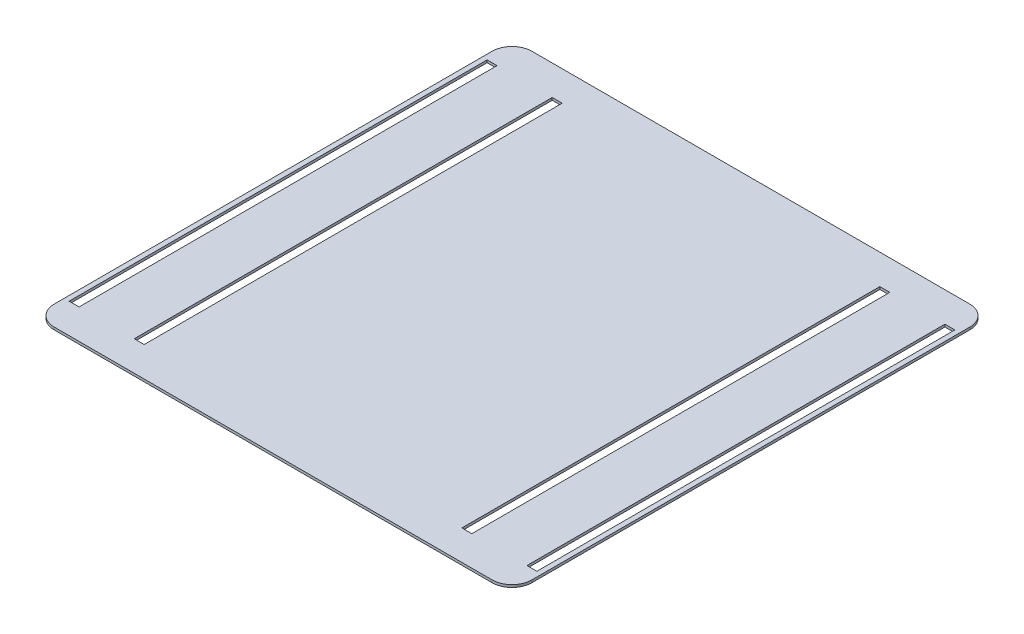
ISO-10303-21;
HEADER;
FILE_DESCRIPTION(('STEP AP214'),'2;1');
FILE_NAME('part.step','',(''),(''),'','','');
FILE_SCHEMA(('AUTOMOTIVE_DESIGN { 1 0 10303 214 1 1 1 1 }'));
ENDSEC;
DATA;
#1=APPLICATION_CONTEXT('core data for automotive mechanical design processes');
#2=APPLICATION_PROTOCOL_DEFINITION('international standard','automotive_design',2000,#1);
#3=PRODUCT_CONTEXT('',#1,'mechanical');
#4=PRODUCT('Part','Part','',(#3));
#5=PRODUCT_RELATED_PRODUCT_CATEGORY('part','',(#4));
#6=PRODUCT_DEFINITION_FORMATION('','',#4);
#7=PRODUCT_DEFINITION_CONTEXT('part definition',#1,'design');
#8=PRODUCT_DEFINITION('design','',#6,#7);
#9=PRODUCT_DEFINITION_SHAPE('','',#8);
#10=(LENGTH_UNIT() NAMED_UNIT(*) SI_UNIT(.MILLI.,.METRE.));
#11=(NAMED_UNIT(*) PLANE_ANGLE_UNIT() SI_UNIT($,.RADIAN.));
#12=(NAMED_UNIT(*) SI_UNIT($,.STERADIAN.) SOLID_ANGLE_UNIT());
#13=UNCERTAINTY_MEASURE_WITH_UNIT(LENGTH_MEASURE(1.E-05),#10,'distance_accuracy_value','');
#14=(GEOMETRIC_REPRESENTATION_CONTEXT(3) GLOBAL_UNCERTAINTY_ASSIGNED_CONTEXT((#13)) GLOBAL_UNIT_ASSIGNED_CONTEXT((#10,
#11,#12)) REPRESENTATION_CONTEXT('',''));
#15=CARTESIAN_POINT('',(0.,0.,0.));
#16=DIRECTION('',(0.,0.,1.));
#17=DIRECTION('',(1.,0.,0.));
#18=AXIS2_PLACEMENT_3D('',#15,#16,#17);
#19=CARTESIAN_POINT('',(0.,3.175,0.));
#20=DIRECTION('',(0.,-1.,0.));
#21=DIRECTION('',(0.,0.,-1.));
#22=AXIS2_PLACEMENT_3D('',#19,#20,#21);
#23=PLANE('',#22);
#24=DIRECTION('',(0.,0.,1.));
#25=VECTOR('',#24,1.);
#26=CARTESIAN_POINT('',(285.75,3.175,-266.7));
#27=LINE('',#26,#25);
#28=CARTESIAN_POINT('',(285.75,3.175,-266.7));
#29=VERTEX_POINT('',#28);
#30=CARTESIAN_POINT('',(285.75,3.175,266.7));
#31=VERTEX_POINT('',#30);
#32=EDGE_CURVE('E281',#29,#31,#27,.T.);
#33=ORIENTED_EDGE('',*,*,#32,.F.);
#34=DIRECTION('',(-1.,0.,0.));
#35=VECTOR('',#34,1.);
#36=CARTESIAN_POINT('',(298.45,3.175,-266.7));
#37=LINE('',#36,#35);
#38=CARTESIAN_POINT('',(298.45,3.175,-266.7));
#39=VERTEX_POINT('',#38);
#40=EDGE_CURVE('E48',#39,#29,#37,.T.);
#41=ORIENTED_EDGE('',*,*,#40,.F.);
#42=DIRECTION('',(0.,0.,1.));
#43=VECTOR('',#42,1.);
#44=CARTESIAN_POINT('',(298.45,3.175,-266.7));
#45=LINE('',#44,#43);
#46=CARTESIAN_POINT('',(298.45,3.175,266.7));
#47=VERTEX_POINT('',#46);
#48=EDGE_CURVE('E274',#39,#47,#45,.T.);
#49=ORIENTED_EDGE('',*,*,#48,.T.);
#50=DIRECTION('',(-1.,0.,0.));
#51=VECTOR('',#50,1.);
#52=CARTESIAN_POINT('',(298.45,3.175,266.7));
#53=LINE('',#52,#51);
#54=EDGE_CURVE('E277',#47,#31,#53,.T.);
#55=ORIENTED_EDGE('',*,*,#54,.T.);
#56=EDGE_LOOP('',(#33,#41,#49,#55));
#57=FACE_BOUND('',#56,.T.);
#58=DIRECTION('',(0.,0.,-1.));
#59=VECTOR('',#58,1.);
#60=CARTESIAN_POINT('',(202.692,3.175,0.));
#61=LINE('',#60,#59);
#62=CARTESIAN_POINT('',(202.692,3.175,266.7));
#63=VERTEX_POINT('',#62);
#64=CARTESIAN_POINT('',(202.692,3.175,-266.7));
#65=VERTEX_POINT('',#64);
#66=EDGE_CURVE('E220',#63,#65,#61,.T.);
#67=ORIENTED_EDGE('',*,*,#66,.T.);
#68=DIRECTION('',(1.,0.,0.));
#69=VECTOR('',#68,1.);
#70=CARTESIAN_POINT('',(1.16573417585642E-12,3.175,-266.700000000001));
#71=LINE('',#70,#69);
#72=CARTESIAN_POINT('',(215.392,3.175,-266.7));
#73=VERTEX_POINT('',#72);
#74=EDGE_CURVE('E297',#65,#73,#71,.T.);
#75=ORIENTED_EDGE('',*,*,#74,.T.);
#76=DIRECTION('',(0.,0.,-1.));
#77=VECTOR('',#76,1.);
#78=CARTESIAN_POINT('',(215.392,3.175,0.));
#79=LINE('',#78,#77);
#80=CARTESIAN_POINT('',(215.392,3.175,266.7));
#81=VERTEX_POINT('',#80);
#82=EDGE_CURVE('E308',#81,#73,#79,.T.);
#83=ORIENTED_EDGE('',*,*,#82,.F.);
#84=DIRECTION('',(1.,0.,0.));
#85=VECTOR('',#84,1.);
#86=CARTESIAN_POINT('',(0.,3.175,266.7));
#87=LINE('',#86,#85);
#88=EDGE_CURVE('E223',#63,#81,#87,.T.);
#89=ORIENTED_EDGE('',*,*,#88,.F.);
#90=EDGE_LOOP('',(#67,#75,#83,#89));
#91=FACE_BOUND('',#90,.T.);
#92=DIRECTION('',(-1.,0.,0.));
#93=VECTOR('',#92,1.);
#94=CARTESIAN_POINT('',(-304.8,3.175,-304.8));
#95=LINE('',#94,#93);
#96=CARTESIAN_POINT('',(279.4,3.175,-304.8));
#97=VERTEX_POINT('',#96);
#98=CARTESIAN_POINT('',(-279.4,3.175,-304.8));
#99=VERTEX_POINT('',#98);
#100=EDGE_CURVE('E326',#97,#99,#95,.T.);
#101=ORIENTED_EDGE('',*,*,#100,.T.);
#102=CARTESIAN_POINT('',(-279.4,3.175,-279.4));
#103=DIRECTION('',(0.,-1.,0.));
#104=DIRECTION('',(0.,0.,-1.));
#105=AXIS2_PLACEMENT_3D('',#102,#103,#104);
#106=CIRCLE('',#105,25.4);
#107=CARTESIAN_POINT('',(-304.8,3.175,-279.4));
#108=VERTEX_POINT('',#107);
#109=EDGE_CURVE('E370',#99,#108,#106,.F.);
#110=ORIENTED_EDGE('',*,*,#109,.T.);
#111=DIRECTION('',(0.,0.,1.));
#112=VECTOR('',#111,1.);
#113=CARTESIAN_POINT('',(-304.8,3.175,304.8));
#114=LINE('',#113,#112);
#115=CARTESIAN_POINT('',(-304.8,3.175,279.4));
#116=VERTEX_POINT('',#115);
#117=EDGE_CURVE('E330',#108,#116,#114,.T.);
#118=ORIENTED_EDGE('',*,*,#117,.T.);
#119=CARTESIAN_POINT('',(-279.4,3.175,279.4));
#120=DIRECTION('',(0.,-1.,0.));
#121=DIRECTION('',(0.,0.,-1.));
#122=AXIS2_PLACEMENT_3D('',#119,#120,#121);
#123=CIRCLE('',#122,25.4);
#124=CARTESIAN_POINT('',(-279.4,3.175,304.8));
#125=VERTEX_POINT('',#124);
#126=EDGE_CURVE('E366',#116,#125,#123,.F.);
#127=ORIENTED_EDGE('',*,*,#126,.T.);
#128=DIRECTION('',(1.,0.,0.));
#129=VECTOR('',#128,1.);
#130=CARTESIAN_POINT('',(-304.8,3.175,304.8));
#131=LINE('',#130,#129);
#132=CARTESIAN_POINT('',(279.4,3.175,304.8));
#133=VERTEX_POINT('',#132);
#134=EDGE_CURVE('E333',#125,#133,#131,.T.);
#135=ORIENTED_EDGE('',*,*,#134,.T.);
#136=CARTESIAN_POINT('',(279.4,3.175,279.4));
#137=DIRECTION('',(0.,-1.,0.));
#138=DIRECTION('',(0.,0.,-1.));
#139=AXIS2_PLACEMENT_3D('',#136,#137,#138);
#140=CIRCLE('',#139,25.4);
#141=CARTESIAN_POINT('',(304.8,3.175,279.4));
#142=VERTEX_POINT('',#141);
#143=EDGE_CURVE('E364',#133,#142,#140,.F.);
#144=ORIENTED_EDGE('',*,*,#143,.T.);
#145=DIRECTION('',(0.,0.,-1.));
#146=VECTOR('',#145,1.);
#147=CARTESIAN_POINT('',(304.8,3.175,304.8));
#148=LINE('',#147,#146);
#149=CARTESIAN_POINT('',(304.8,3.175,-279.4));
#150=VERTEX_POINT('',#149);
#151=EDGE_CURVE('E323',#142,#150,#148,.T.);
#152=ORIENTED_EDGE('',*,*,#151,.T.);
#153=CARTESIAN_POINT('',(279.4,3.175,-279.4));
#154=DIRECTION('',(0.,-1.,0.));
#155=DIRECTION('',(0.,0.,-1.));
#156=AXIS2_PLACEMENT_3D('',#153,#154,#155);
#157=CIRCLE('',#156,25.4);
#158=EDGE_CURVE('E368',#150,#97,#157,.F.);
#159=ORIENTED_EDGE('',*,*,#158,.T.);
#160=EDGE_LOOP('',(#101,#110,#118,#127,#135,#144,#152,#159));
#161=FACE_BOUND('',#160,.T.);
#162=DIRECTION('',(0.,0.,-1.));
#163=VECTOR('',#162,1.);
#164=CARTESIAN_POINT('',(-215.392,3.175,266.7));
#165=LINE('',#164,#163);
#166=CARTESIAN_POINT('',(-215.392,3.175,266.7));
#167=VERTEX_POINT('',#166);
#168=CARTESIAN_POINT('',(-215.392,3.175,-266.7));
#169=VERTEX_POINT('',#168);
#170=EDGE_CURVE('E219',#167,#169,#165,.T.);
#171=ORIENTED_EDGE('',*,*,#170,.T.);
#172=DIRECTION('',(-1.,0.,0.));
#173=VECTOR('',#172,1.);
#174=CARTESIAN_POINT('',(-202.692,3.175,-266.7));
#175=LINE('',#174,#173);
#176=CARTESIAN_POINT('',(-202.692,3.175,-266.7));
#177=VERTEX_POINT('',#176);
#178=EDGE_CURVE('E199',#177,#169,#175,.T.);
#179=ORIENTED_EDGE('',*,*,#178,.F.);
#180=DIRECTION('',(0.,0.,-1.));
#181=VECTOR('',#180,1.);
#182=CARTESIAN_POINT('',(-202.692,3.175,266.7));
#183=LINE('',#182,#181);
#184=CARTESIAN_POINT('',(-202.692,3.175,266.7));
#185=VERTEX_POINT('',#184);
#186=EDGE_CURVE('E209',#185,#177,#183,.T.);
#187=ORIENTED_EDGE('',*,*,#186,.F.);
#188=DIRECTION('',(-1.,0.,0.));
#189=VECTOR('',#188,1.);
#190=CARTESIAN_POINT('',(-202.692,3.175,266.7));
#191=LINE('',#190,#189);
#192=EDGE_CURVE('E214',#185,#167,#191,.T.);
#193=ORIENTED_EDGE('',*,*,#192,.T.);
#194=EDGE_LOOP('',(#171,#179,#187,#193));
#195=FACE_BOUND('',#194,.T.);
#196=DIRECTION('',(1.,0.,0.));
#197=VECTOR('',#196,1.);
#198=CARTESIAN_POINT('',(-298.45,3.175,-266.7));
#199=LINE('',#198,#197);
#200=CARTESIAN_POINT('',(-298.45,3.175,-266.7));
#201=VERTEX_POINT('',#200);
#202=CARTESIAN_POINT('',(-285.75,3.175,-266.7));
#203=VERTEX_POINT('',#202);
#204=EDGE_CURVE('E56',#201,#203,#199,.T.);
#205=ORIENTED_EDGE('',*,*,#204,.T.);
#206=DIRECTION('',(0.,0.,1.));
#207=VECTOR('',#206,1.);
#208=CARTESIAN_POINT('',(-285.75,3.175,-266.7));
#209=LINE('',#208,#207);
#210=CARTESIAN_POINT('',(-285.75,3.175,266.7));
#211=VERTEX_POINT('',#210);
#212=EDGE_CURVE('E253',#203,#211,#209,.T.);
#213=ORIENTED_EDGE('',*,*,#212,.T.);
#214=DIRECTION('',(1.,0.,0.));
#215=VECTOR('',#214,1.);
#216=CARTESIAN_POINT('',(-298.45,3.175,266.7));
#217=LINE('',#216,#215);
#218=CARTESIAN_POINT('',(-298.45,3.175,266.7));
#219=VERTEX_POINT('',#218);
#220=EDGE_CURVE('E249',#219,#211,#217,.T.);
#221=ORIENTED_EDGE('',*,*,#220,.F.);
#222=DIRECTION('',(0.,0.,1.));
#223=VECTOR('',#222,1.);
#224=CARTESIAN_POINT('',(-298.45,3.175,-266.7));
#225=LINE('',#224,#223);
#226=EDGE_CURVE('E246',#201,#219,#225,.T.);
#227=ORIENTED_EDGE('',*,*,#226,.F.);
#228=EDGE_LOOP('',(#205,#213,#221,#227));
#229=FACE_BOUND('',#228,.T.);
#230=ADVANCED_FACE('F33',(#57,#91,#161,#195,#229),#23,.F.);
#231=CARTESIAN_POINT('',(0.,0.,0.));
#232=DIRECTION('',(0.,-1.,0.));
#233=DIRECTION('',(0.,0.,-1.));
#234=AXIS2_PLACEMENT_3D('',#231,#232,#233);
#235=PLANE('',#234);
#236=DIRECTION('',(-1.,0.,0.));
#237=VECTOR('',#236,1.);
#238=CARTESIAN_POINT('',(298.45,0.,-266.7));
#239=LINE('',#238,#237);
#240=CARTESIAN_POINT('',(298.45,0.,-266.7));
#241=VERTEX_POINT('',#240);
#242=CARTESIAN_POINT('',(285.75,0.,-266.7));
#243=VERTEX_POINT('',#242);
#244=EDGE_CURVE('E278',#241,#243,#239,.T.);
#245=ORIENTED_EDGE('',*,*,#244,.T.);
#246=DIRECTION('',(0.,0.,1.));
#247=VECTOR('',#246,1.);
#248=CARTESIAN_POINT('',(285.75,0.,-266.7));
#249=LINE('',#248,#247);
#250=CARTESIAN_POINT('',(285.75,0.,266.7));
#251=VERTEX_POINT('',#250);
#252=EDGE_CURVE('E289',#243,#251,#249,.T.);
#253=ORIENTED_EDGE('',*,*,#252,.T.);
#254=DIRECTION('',(-1.,0.,0.));
#255=VECTOR('',#254,1.);
#256=CARTESIAN_POINT('',(298.45,0.,266.7));
#257=LINE('',#256,#255);
#258=CARTESIAN_POINT('',(298.45,0.,266.7));
#259=VERTEX_POINT('',#258);
#260=EDGE_CURVE('E286',#259,#251,#257,.T.);
#261=ORIENTED_EDGE('',*,*,#260,.F.);
#262=DIRECTION('',(0.,0.,1.));
#263=VECTOR('',#262,1.);
#264=CARTESIAN_POINT('',(298.45,0.,-266.7));
#265=LINE('',#264,#263);
#266=EDGE_CURVE('E267',#241,#259,#265,.T.);
#267=ORIENTED_EDGE('',*,*,#266,.F.);
#268=EDGE_LOOP('',(#245,#253,#261,#267));
#269=FACE_BOUND('',#268,.T.);
#270=DIRECTION('',(-1.,0.,0.));
#271=VECTOR('',#270,1.);
#272=CARTESIAN_POINT('',(-202.692,0.,-266.7));
#273=LINE('',#272,#271);
#274=CARTESIAN_POINT('',(-202.692,0.,-266.7));
#275=VERTEX_POINT('',#274);
#276=CARTESIAN_POINT('',(-215.392,0.,-266.7));
#277=VERTEX_POINT('',#276);
#278=EDGE_CURVE('E202',#275,#277,#273,.T.);
#279=ORIENTED_EDGE('',*,*,#278,.T.);
#280=DIRECTION('',(0.,0.,-1.));
#281=VECTOR('',#280,1.);
#282=CARTESIAN_POINT('',(-215.392,0.,266.7));
#283=LINE('',#282,#281);
#284=CARTESIAN_POINT('',(-215.392,0.,266.7));
#285=VERTEX_POINT('',#284);
#286=EDGE_CURVE('E234',#285,#277,#283,.T.);
#287=ORIENTED_EDGE('',*,*,#286,.F.);
#288=DIRECTION('',(-1.,0.,0.));
#289=VECTOR('',#288,1.);
#290=CARTESIAN_POINT('',(-202.692,0.,266.7));
#291=LINE('',#290,#289);
#292=CARTESIAN_POINT('',(-202.692,0.,266.7));
#293=VERTEX_POINT('',#292);
#294=EDGE_CURVE('E230',#293,#285,#291,.T.);
#295=ORIENTED_EDGE('',*,*,#294,.F.);
#296=DIRECTION('',(0.,0.,-1.));
#297=VECTOR('',#296,1.);
#298=CARTESIAN_POINT('',(-202.692,0.,266.7));
#299=LINE('',#298,#297);
#300=EDGE_CURVE('E228',#293,#275,#299,.T.);
#301=ORIENTED_EDGE('',*,*,#300,.T.);
#302=EDGE_LOOP('',(#279,#287,#295,#301));
#303=FACE_BOUND('',#302,.T.);
#304=DIRECTION('',(0.,0.,1.));
#305=VECTOR('',#304,1.);
#306=CARTESIAN_POINT('',(-304.8,0.,304.8));
#307=LINE('',#306,#305);
#308=CARTESIAN_POINT('',(-304.8,0.,-279.4));
#309=VERTEX_POINT('',#308);
#310=CARTESIAN_POINT('',(-304.8,0.,279.4));
#311=VERTEX_POINT('',#310);
#312=EDGE_CURVE('E342',#309,#311,#307,.T.);
#313=ORIENTED_EDGE('',*,*,#312,.F.);
#314=CARTESIAN_POINT('',(-279.4,0.,-279.4));
#315=DIRECTION('',(0.,-1.,0.));
#316=DIRECTION('',(0.,0.,-1.));
#317=AXIS2_PLACEMENT_3D('',#314,#315,#316);
#318=CIRCLE('',#317,25.4);
#319=CARTESIAN_POINT('',(-279.4,0.,-304.8));
#320=VERTEX_POINT('',#319);
#321=EDGE_CURVE('E357',#309,#320,#318,.T.);
#322=ORIENTED_EDGE('',*,*,#321,.T.);
#323=DIRECTION('',(-1.,0.,0.));
#324=VECTOR('',#323,1.);
#325=CARTESIAN_POINT('',(-304.8,0.,-304.8));
#326=LINE('',#325,#324);
#327=CARTESIAN_POINT('',(279.4,0.,-304.8));
#328=VERTEX_POINT('',#327);
#329=EDGE_CURVE('E339',#328,#320,#326,.T.);
#330=ORIENTED_EDGE('',*,*,#329,.F.);
#331=CARTESIAN_POINT('',(279.4,0.,-279.4));
#332=DIRECTION('',(0.,-1.,0.));
#333=DIRECTION('',(0.,0.,-1.));
#334=AXIS2_PLACEMENT_3D('',#331,#332,#333);
#335=CIRCLE('',#334,25.4);
#336=CARTESIAN_POINT('',(304.8,0.,-279.4));
#337=VERTEX_POINT('',#336);
#338=EDGE_CURVE('E355',#328,#337,#335,.T.);
#339=ORIENTED_EDGE('',*,*,#338,.T.);
#340=DIRECTION('',(0.,0.,-1.));
#341=VECTOR('',#340,1.);
#342=CARTESIAN_POINT('',(304.8,0.,304.8));
#343=LINE('',#342,#341);
#344=CARTESIAN_POINT('',(304.8,0.,279.4));
#345=VERTEX_POINT('',#344);
#346=EDGE_CURVE('E316',#345,#337,#343,.T.);
#347=ORIENTED_EDGE('',*,*,#346,.F.);
#348=CARTESIAN_POINT('',(279.4,0.,279.4));
#349=DIRECTION('',(0.,-1.,0.));
#350=DIRECTION('',(0.,0.,-1.));
#351=AXIS2_PLACEMENT_3D('',#348,#349,#350);
#352=CIRCLE('',#351,25.4);
#353=CARTESIAN_POINT('',(279.4,0.,304.8));
#354=VERTEX_POINT('',#353);
#355=EDGE_CURVE('E351',#345,#354,#352,.T.);
#356=ORIENTED_EDGE('',*,*,#355,.T.);
#357=DIRECTION('',(1.,0.,0.));
#358=VECTOR('',#357,1.);
#359=CARTESIAN_POINT('',(-304.8,0.,304.8));
#360=LINE('',#359,#358);
#361=CARTESIAN_POINT('',(-279.4,0.,304.8));
#362=VERTEX_POINT('',#361);
#363=EDGE_CURVE('E327',#362,#354,#360,.T.);
#364=ORIENTED_EDGE('',*,*,#363,.F.);
#365=CARTESIAN_POINT('',(-279.4,0.,279.4));
#366=DIRECTION('',(0.,-1.,0.));
#367=DIRECTION('',(0.,0.,-1.));
#368=AXIS2_PLACEMENT_3D('',#365,#366,#367);
#369=CIRCLE('',#368,25.4);
#370=EDGE_CURVE('E353',#362,#311,#369,.T.);
#371=ORIENTED_EDGE('',*,*,#370,.T.);
#372=EDGE_LOOP('',(#313,#322,#330,#339,#347,#356,#364,#371));
#373=FACE_BOUND('',#372,.T.);
#374=DIRECTION('',(1.,0.,0.));
#375=VECTOR('',#374,1.);
#376=CARTESIAN_POINT('',(1.16573417585642E-12,0.,-266.700000000001));
#377=LINE('',#376,#375);
#378=CARTESIAN_POINT('',(202.692,0.,-266.7));
#379=VERTEX_POINT('',#378);
#380=CARTESIAN_POINT('',(215.392,0.,-266.7));
#381=VERTEX_POINT('',#380);
#382=EDGE_CURVE('E303',#379,#381,#377,.T.);
#383=ORIENTED_EDGE('',*,*,#382,.F.);
#384=DIRECTION('',(0.,0.,-1.));
#385=VECTOR('',#384,1.);
#386=CARTESIAN_POINT('',(202.692,0.,0.));
#387=LINE('',#386,#385);
#388=CARTESIAN_POINT('',(202.692,0.,266.7));
#389=VERTEX_POINT('',#388);
#390=EDGE_CURVE('E294',#389,#379,#387,.T.);
#391=ORIENTED_EDGE('',*,*,#390,.F.);
#392=DIRECTION('',(1.,0.,0.));
#393=VECTOR('',#392,1.);
#394=CARTESIAN_POINT('',(0.,0.,266.7));
#395=LINE('',#394,#393);
#396=CARTESIAN_POINT('',(215.392,0.,266.7));
#397=VERTEX_POINT('',#396);
#398=EDGE_CURVE('E296',#389,#397,#395,.T.);
#399=ORIENTED_EDGE('',*,*,#398,.T.);
#400=DIRECTION('',(0.,0.,-1.));
#401=VECTOR('',#400,1.);
#402=CARTESIAN_POINT('',(215.392,0.,0.));
#403=LINE('',#402,#401);
#404=EDGE_CURVE('E300',#397,#381,#403,.T.);
#405=ORIENTED_EDGE('',*,*,#404,.T.);
#406=EDGE_LOOP('',(#383,#391,#399,#405));
#407=FACE_BOUND('',#406,.T.);
#408=DIRECTION('',(0.,0.,1.));
#409=VECTOR('',#408,1.);
#410=CARTESIAN_POINT('',(-285.75,0.,-266.7));
#411=LINE('',#410,#409);
#412=CARTESIAN_POINT('',(-285.75,0.,-266.7));
#413=VERTEX_POINT('',#412);
#414=CARTESIAN_POINT('',(-285.75,0.,266.7));
#415=VERTEX_POINT('',#414);
#416=EDGE_CURVE('E262',#413,#415,#411,.T.);
#417=ORIENTED_EDGE('',*,*,#416,.F.);
#418=DIRECTION('',(1.,0.,0.));
#419=VECTOR('',#418,1.);
#420=CARTESIAN_POINT('',(-298.45,0.,-266.7));
#421=LINE('',#420,#419);
#422=CARTESIAN_POINT('',(-298.45,0.,-266.7));
#423=VERTEX_POINT('',#422);
#424=EDGE_CURVE('E250',#423,#413,#421,.T.);
#425=ORIENTED_EDGE('',*,*,#424,.F.);
#426=DIRECTION('',(0.,0.,1.));
#427=VECTOR('',#426,1.);
#428=CARTESIAN_POINT('',(-298.45,0.,-266.7));
#429=LINE('',#428,#427);
#430=CARTESIAN_POINT('',(-298.45,0.,266.7));
#431=VERTEX_POINT('',#430);
#432=EDGE_CURVE('E245',#423,#431,#429,.T.);
#433=ORIENTED_EDGE('',*,*,#432,.T.);
#434=DIRECTION('',(1.,0.,0.));
#435=VECTOR('',#434,1.);
#436=CARTESIAN_POINT('',(-298.45,0.,266.7));
#437=LINE('',#436,#435);
#438=EDGE_CURVE('E259',#431,#415,#437,.T.);
#439=ORIENTED_EDGE('',*,*,#438,.T.);
#440=EDGE_LOOP('',(#417,#425,#433,#439));
#441=FACE_BOUND('',#440,.T.);
#442=ADVANCED_FACE('F394',(#269,#303,#373,#407,#441),#235,.T.);
#443=CARTESIAN_POINT('',(304.8,3.175,304.8));
#444=DIRECTION('',(-1.,0.,0.));
#445=DIRECTION('',(0.,0.,1.));
#446=AXIS2_PLACEMENT_3D('',#443,#444,#445);
#447=PLANE('',#446);
#448=ORIENTED_EDGE('',*,*,#346,.T.);
#449=DIRECTION('',(0.,-1.,0.));
#450=VECTOR('',#449,1.);
#451=CARTESIAN_POINT('',(304.8,3.175,-279.4));
#452=LINE('',#451,#450);
#453=EDGE_CURVE('E375',#337,#150,#452,.F.);
#454=ORIENTED_EDGE('',*,*,#453,.T.);
#455=ORIENTED_EDGE('',*,*,#151,.F.);
#456=DIRECTION('',(0.,-1.,0.));
#457=VECTOR('',#456,1.);
#458=CARTESIAN_POINT('',(304.8,3.175,279.4));
#459=LINE('',#458,#457);
#460=EDGE_CURVE('E372',#142,#345,#459,.T.);
#461=ORIENTED_EDGE('',*,*,#460,.T.);
#462=EDGE_LOOP('',(#448,#454,#455,#461));
#463=FACE_BOUND('',#462,.T.);
#464=ADVANCED_FACE('F390',(#463),#447,.F.);
#465=CARTESIAN_POINT('',(-304.8,3.175,-304.8));
#466=DIRECTION('',(0.,0.,1.));
#467=DIRECTION('',(1.,0.,0.));
#468=AXIS2_PLACEMENT_3D('',#465,#466,#467);
#469=PLANE('',#468);
#470=ORIENTED_EDGE('',*,*,#329,.T.);
#471=DIRECTION('',(0.,-1.,0.));
#472=VECTOR('',#471,1.);
#473=CARTESIAN_POINT('',(-279.4,3.175,-304.8));
#474=LINE('',#473,#472);
#475=EDGE_CURVE('E362',#320,#99,#474,.F.);
#476=ORIENTED_EDGE('',*,*,#475,.T.);
#477=ORIENTED_EDGE('',*,*,#100,.F.);
#478=DIRECTION('',(0.,-1.,0.));
#479=VECTOR('',#478,1.);
#480=CARTESIAN_POINT('',(279.4,3.175,-304.8));
#481=LINE('',#480,#479);
#482=EDGE_CURVE('E359',#97,#328,#481,.T.);
#483=ORIENTED_EDGE('',*,*,#482,.T.);
#484=EDGE_LOOP('',(#470,#476,#477,#483));
#485=FACE_BOUND('',#484,.T.);
#486=ADVANCED_FACE('F403',(#485),#469,.F.);
#487=CARTESIAN_POINT('',(-304.8,3.175,304.8));
#488=DIRECTION('',(1.,0.,0.));
#489=DIRECTION('',(0.,0.,-1.));
#490=AXIS2_PLACEMENT_3D('',#487,#488,#489);
#491=PLANE('',#490);
#492=ORIENTED_EDGE('',*,*,#117,.F.);
#493=DIRECTION('',(0.,-1.,0.));
#494=VECTOR('',#493,1.);
#495=CARTESIAN_POINT('',(-304.8,3.175,-279.4));
#496=LINE('',#495,#494);
#497=EDGE_CURVE('E348',#108,#309,#496,.T.);
#498=ORIENTED_EDGE('',*,*,#497,.T.);
#499=ORIENTED_EDGE('',*,*,#312,.T.);
#500=DIRECTION('',(0.,-1.,0.));
#501=VECTOR('',#500,1.);
#502=CARTESIAN_POINT('',(-304.8,3.175,279.4));
#503=LINE('',#502,#501);
#504=EDGE_CURVE('E336',#311,#116,#503,.F.);
#505=ORIENTED_EDGE('',*,*,#504,.T.);
#506=EDGE_LOOP('',(#492,#498,#499,#505));
#507=FACE_BOUND('',#506,.T.);
#508=ADVANCED_FACE('F411',(#507),#491,.F.);
#509=CARTESIAN_POINT('',(-304.8,3.175,304.8));
#510=DIRECTION('',(0.,0.,-1.));
#511=DIRECTION('',(-1.,0.,0.));
#512=AXIS2_PLACEMENT_3D('',#509,#510,#511);
#513=PLANE('',#512);
#514=ORIENTED_EDGE('',*,*,#134,.F.);
#515=DIRECTION('',(0.,-1.,0.));
#516=VECTOR('',#515,1.);
#517=CARTESIAN_POINT('',(-279.4,3.175,304.8));
#518=LINE('',#517,#516);
#519=EDGE_CURVE('E11',#125,#362,#518,.T.);
#520=ORIENTED_EDGE('',*,*,#519,.T.);
#521=ORIENTED_EDGE('',*,*,#363,.T.);
#522=DIRECTION('',(0.,-1.,0.));
#523=VECTOR('',#522,1.);
#524=CARTESIAN_POINT('',(279.4,3.175,304.8));
#525=LINE('',#524,#523);
#526=EDGE_CURVE('E41',#354,#133,#525,.F.);
#527=ORIENTED_EDGE('',*,*,#526,.T.);
#528=EDGE_LOOP('',(#514,#520,#521,#527));
#529=FACE_BOUND('',#528,.T.);
#530=ADVANCED_FACE('F379',(#529),#513,.F.);
#531=CARTESIAN_POINT('',(-279.4,3.175,-279.4));
#532=DIRECTION('',(0.,-1.,0.));
#533=DIRECTION('',(0.,0.,-1.));
#534=AXIS2_PLACEMENT_3D('',#531,#532,#533);
#535=CYLINDRICAL_SURFACE('',#534,25.4);
#536=ORIENTED_EDGE('',*,*,#109,.F.);
#537=ORIENTED_EDGE('',*,*,#475,.F.);
#538=ORIENTED_EDGE('',*,*,#321,.F.);
#539=ORIENTED_EDGE('',*,*,#497,.F.);
#540=EDGE_LOOP('',(#536,#537,#538,#539));
#541=FACE_BOUND('',#540,.T.);
#542=ADVANCED_FACE('F409',(#541),#535,.T.);
#543=CARTESIAN_POINT('',(279.4,3.175,-279.4));
#544=DIRECTION('',(0.,-1.,0.));
#545=DIRECTION('',(0.,0.,-1.));
#546=AXIS2_PLACEMENT_3D('',#543,#544,#545);
#547=CYLINDRICAL_SURFACE('',#546,25.4);
#548=ORIENTED_EDGE('',*,*,#158,.F.);
#549=ORIENTED_EDGE('',*,*,#453,.F.);
#550=ORIENTED_EDGE('',*,*,#338,.F.);
#551=ORIENTED_EDGE('',*,*,#482,.F.);
#552=EDGE_LOOP('',(#548,#549,#550,#551));
#553=FACE_BOUND('',#552,.T.);
#554=ADVANCED_FACE('F400',(#553),#547,.T.);
#555=CARTESIAN_POINT('',(-279.4,3.175,279.4));
#556=DIRECTION('',(0.,-1.,0.));
#557=DIRECTION('',(0.,0.,-1.));
#558=AXIS2_PLACEMENT_3D('',#555,#556,#557);
#559=CYLINDRICAL_SURFACE('',#558,25.4);
#560=ORIENTED_EDGE('',*,*,#126,.F.);
#561=ORIENTED_EDGE('',*,*,#504,.F.);
#562=ORIENTED_EDGE('',*,*,#370,.F.);
#563=ORIENTED_EDGE('',*,*,#519,.F.);
#564=EDGE_LOOP('',(#560,#561,#562,#563));
#565=FACE_BOUND('',#564,.T.);
#566=ADVANCED_FACE('F414',(#565),#559,.T.);
#567=CARTESIAN_POINT('',(279.4,3.175,279.4));
#568=DIRECTION('',(0.,-1.,0.));
#569=DIRECTION('',(0.,0.,-1.));
#570=AXIS2_PLACEMENT_3D('',#567,#568,#569);
#571=CYLINDRICAL_SURFACE('',#570,25.4);
#572=ORIENTED_EDGE('',*,*,#143,.F.);
#573=ORIENTED_EDGE('',*,*,#526,.F.);
#574=ORIENTED_EDGE('',*,*,#355,.F.);
#575=ORIENTED_EDGE('',*,*,#460,.F.);
#576=EDGE_LOOP('',(#572,#573,#574,#575));
#577=FACE_BOUND('',#576,.T.);
#578=ADVANCED_FACE('F35',(#577),#571,.T.);
#579=CARTESIAN_POINT('',(202.692,0.,0.));
#580=DIRECTION('',(1.,0.,0.));
#581=DIRECTION('',(0.,0.,-1.));
#582=AXIS2_PLACEMENT_3D('',#579,#580,#581);
#583=PLANE('',#582);
#584=ORIENTED_EDGE('',*,*,#66,.F.);
#585=DIRECTION('',(0.,1.,0.));
#586=VECTOR('',#585,1.);
#587=CARTESIAN_POINT('',(202.692,0.,266.7));
#588=LINE('',#587,#586);
#589=EDGE_CURVE('E304',#389,#63,#588,.T.);
#590=ORIENTED_EDGE('',*,*,#589,.F.);
#591=ORIENTED_EDGE('',*,*,#390,.T.);
#592=DIRECTION('',(0.,1.,0.));
#593=VECTOR('',#592,1.);
#594=CARTESIAN_POINT('',(202.692,0.,-266.7));
#595=LINE('',#594,#593);
#596=EDGE_CURVE('E313',#379,#65,#595,.T.);
#597=ORIENTED_EDGE('',*,*,#596,.T.);
#598=EDGE_LOOP('',(#584,#590,#591,#597));
#599=FACE_BOUND('',#598,.T.);
#600=ADVANCED_FACE('F420',(#599),#583,.T.);
#601=CARTESIAN_POINT('',(1.16573417585642E-12,0.,-266.700000000001));
#602=DIRECTION('',(0.,0.,1.));
#603=DIRECTION('',(1.,0.,0.));
#604=AXIS2_PLACEMENT_3D('',#601,#602,#603);
#605=PLANE('',#604);
#606=ORIENTED_EDGE('',*,*,#74,.F.);
#607=ORIENTED_EDGE('',*,*,#596,.F.);
#608=ORIENTED_EDGE('',*,*,#382,.T.);
#609=DIRECTION('',(0.,1.,0.));
#610=VECTOR('',#609,1.);
#611=CARTESIAN_POINT('',(215.392,0.,-266.7));
#612=LINE('',#611,#610);
#613=EDGE_CURVE('E317',#381,#73,#612,.T.);
#614=ORIENTED_EDGE('',*,*,#613,.T.);
#615=EDGE_LOOP('',(#606,#607,#608,#614));
#616=FACE_BOUND('',#615,.T.);
#617=ADVANCED_FACE('F481',(#616),#605,.T.);
#618=CARTESIAN_POINT('',(215.392,0.,0.));
#619=DIRECTION('',(1.,0.,0.));
#620=DIRECTION('',(0.,0.,-1.));
#621=AXIS2_PLACEMENT_3D('',#618,#619,#620);
#622=PLANE('',#621);
#623=ORIENTED_EDGE('',*,*,#82,.T.);
#624=ORIENTED_EDGE('',*,*,#613,.F.);
#625=ORIENTED_EDGE('',*,*,#404,.F.);
#626=DIRECTION('',(0.,1.,0.));
#627=VECTOR('',#626,1.);
#628=CARTESIAN_POINT('',(215.392,0.,266.7));
#629=LINE('',#628,#627);
#630=EDGE_CURVE('E319',#397,#81,#629,.T.);
#631=ORIENTED_EDGE('',*,*,#630,.T.);
#632=EDGE_LOOP('',(#623,#624,#625,#631));
#633=FACE_BOUND('',#632,.T.);
#634=ADVANCED_FACE('F490',(#633),#622,.F.);
#635=CARTESIAN_POINT('',(0.,0.,266.7));
#636=DIRECTION('',(0.,0.,1.));
#637=DIRECTION('',(1.,0.,0.));
#638=AXIS2_PLACEMENT_3D('',#635,#636,#637);
#639=PLANE('',#638);
#640=ORIENTED_EDGE('',*,*,#88,.T.);
#641=ORIENTED_EDGE('',*,*,#630,.F.);
#642=ORIENTED_EDGE('',*,*,#398,.F.);
#643=ORIENTED_EDGE('',*,*,#589,.T.);
#644=EDGE_LOOP('',(#640,#641,#642,#643));
#645=FACE_BOUND('',#644,.T.);
#646=ADVANCED_FACE('F500',(#645),#639,.F.);
#647=CARTESIAN_POINT('',(-202.692,0.,-266.7));
#648=DIRECTION('',(0.,0.,-1.));
#649=DIRECTION('',(-1.,0.,0.));
#650=AXIS2_PLACEMENT_3D('',#647,#648,#649);
#651=PLANE('',#650);
#652=ORIENTED_EDGE('',*,*,#178,.T.);
#653=DIRECTION('',(0.,1.,0.));
#654=VECTOR('',#653,1.);
#655=CARTESIAN_POINT('',(-215.392,0.,-266.7));
#656=LINE('',#655,#654);
#657=EDGE_CURVE('E231',#277,#169,#656,.T.);
#658=ORIENTED_EDGE('',*,*,#657,.F.);
#659=ORIENTED_EDGE('',*,*,#278,.F.);
#660=DIRECTION('',(0.,1.,0.));
#661=VECTOR('',#660,1.);
#662=CARTESIAN_POINT('',(-202.692,0.,-266.7));
#663=LINE('',#662,#661);
#664=EDGE_CURVE('E194',#275,#177,#663,.T.);
#665=ORIENTED_EDGE('',*,*,#664,.T.);
#666=EDGE_LOOP('',(#652,#658,#659,#665));
#667=FACE_BOUND('',#666,.T.);
#668=ADVANCED_FACE('F196',(#667),#651,.F.);
#669=CARTESIAN_POINT('',(-202.692,0.,266.7));
#670=DIRECTION('',(1.,0.,0.));
#671=DIRECTION('',(0.,0.,-1.));
#672=AXIS2_PLACEMENT_3D('',#669,#670,#671);
#673=PLANE('',#672);
#674=ORIENTED_EDGE('',*,*,#186,.T.);
#675=ORIENTED_EDGE('',*,*,#664,.F.);
#676=ORIENTED_EDGE('',*,*,#300,.F.);
#677=DIRECTION('',(0.,1.,0.));
#678=VECTOR('',#677,1.);
#679=CARTESIAN_POINT('',(-202.692,0.,266.7));
#680=LINE('',#679,#678);
#681=EDGE_CURVE('E206',#293,#185,#680,.T.);
#682=ORIENTED_EDGE('',*,*,#681,.T.);
#683=EDGE_LOOP('',(#674,#675,#676,#682));
#684=FACE_BOUND('',#683,.T.);
#685=ADVANCED_FACE('F210',(#684),#673,.F.);
#686=CARTESIAN_POINT('',(-202.692,0.,266.7));
#687=DIRECTION('',(0.,0.,-1.));
#688=DIRECTION('',(-1.,0.,0.));
#689=AXIS2_PLACEMENT_3D('',#686,#687,#688);
#690=PLANE('',#689);
#691=ORIENTED_EDGE('',*,*,#192,.F.);
#692=ORIENTED_EDGE('',*,*,#681,.F.);
#693=ORIENTED_EDGE('',*,*,#294,.T.);
#694=DIRECTION('',(0.,1.,0.));
#695=VECTOR('',#694,1.);
#696=CARTESIAN_POINT('',(-215.392,0.,266.7));
#697=LINE('',#696,#695);
#698=EDGE_CURVE('E637',#285,#167,#697,.T.);
#699=ORIENTED_EDGE('',*,*,#698,.T.);
#700=EDGE_LOOP('',(#691,#692,#693,#699));
#701=FACE_BOUND('',#700,.T.);
#702=ADVANCED_FACE('F526',(#701),#690,.T.);
#703=CARTESIAN_POINT('',(-215.392,0.,266.7));
#704=DIRECTION('',(1.,0.,0.));
#705=DIRECTION('',(0.,0.,-1.));
#706=AXIS2_PLACEMENT_3D('',#703,#704,#705);
#707=PLANE('',#706);
#708=ORIENTED_EDGE('',*,*,#170,.F.);
#709=ORIENTED_EDGE('',*,*,#698,.F.);
#710=ORIENTED_EDGE('',*,*,#286,.T.);
#711=ORIENTED_EDGE('',*,*,#657,.T.);
#712=EDGE_LOOP('',(#708,#709,#710,#711));
#713=FACE_BOUND('',#712,.T.);
#714=ADVANCED_FACE('F535',(#713),#707,.T.);
#715=CARTESIAN_POINT('',(-298.45,0.,-266.7));
#716=DIRECTION('',(0.,0.,1.));
#717=DIRECTION('',(1.,0.,0.));
#718=AXIS2_PLACEMENT_3D('',#715,#716,#717);
#719=PLANE('',#718);
#720=ORIENTED_EDGE('',*,*,#204,.F.);
#721=DIRECTION('',(0.,1.,0.));
#722=VECTOR('',#721,1.);
#723=CARTESIAN_POINT('',(-298.45,0.,-266.7));
#724=LINE('',#723,#722);
#725=EDGE_CURVE('E243',#423,#201,#724,.T.);
#726=ORIENTED_EDGE('',*,*,#725,.F.);
#727=ORIENTED_EDGE('',*,*,#424,.T.);
#728=DIRECTION('',(0.,1.,0.));
#729=VECTOR('',#728,1.);
#730=CARTESIAN_POINT('',(-285.75,0.,-266.7));
#731=LINE('',#730,#729);
#732=EDGE_CURVE('E237',#413,#203,#731,.T.);
#733=ORIENTED_EDGE('',*,*,#732,.T.);
#734=EDGE_LOOP('',(#720,#726,#727,#733));
#735=FACE_BOUND('',#734,.T.);
#736=ADVANCED_FACE('F545',(#735),#719,.T.);
#737=CARTESIAN_POINT('',(-285.75,0.,-266.7));
#738=DIRECTION('',(-1.,0.,0.));
#739=DIRECTION('',(0.,0.,1.));
#740=AXIS2_PLACEMENT_3D('',#737,#738,#739);
#741=PLANE('',#740);
#742=ORIENTED_EDGE('',*,*,#212,.F.);
#743=ORIENTED_EDGE('',*,*,#732,.F.);
#744=ORIENTED_EDGE('',*,*,#416,.T.);
#745=DIRECTION('',(0.,1.,0.));
#746=VECTOR('',#745,1.);
#747=CARTESIAN_POINT('',(-285.75,0.,266.7));
#748=LINE('',#747,#746);
#749=EDGE_CURVE('E239',#415,#211,#748,.T.);
#750=ORIENTED_EDGE('',*,*,#749,.T.);
#751=EDGE_LOOP('',(#742,#743,#744,#750));
#752=FACE_BOUND('',#751,.T.);
#753=ADVANCED_FACE('F555',(#752),#741,.T.);
#754=CARTESIAN_POINT('',(-298.45,0.,266.7));
#755=DIRECTION('',(0.,0.,1.));
#756=DIRECTION('',(1.,0.,0.));
#757=AXIS2_PLACEMENT_3D('',#754,#755,#756);
#758=PLANE('',#757);
#759=ORIENTED_EDGE('',*,*,#220,.T.);
#760=ORIENTED_EDGE('',*,*,#749,.F.);
#761=ORIENTED_EDGE('',*,*,#438,.F.);
#762=DIRECTION('',(0.,1.,0.));
#763=VECTOR('',#762,1.);
#764=CARTESIAN_POINT('',(-298.45,0.,266.7));
#765=LINE('',#764,#763);
#766=EDGE_CURVE('E241',#431,#219,#765,.T.);
#767=ORIENTED_EDGE('',*,*,#766,.T.);
#768=EDGE_LOOP('',(#759,#760,#761,#767));
#769=FACE_BOUND('',#768,.T.);
#770=ADVANCED_FACE('F564',(#769),#758,.F.);
#771=CARTESIAN_POINT('',(-298.45,0.,-266.7));
#772=DIRECTION('',(-1.,0.,0.));
#773=DIRECTION('',(0.,0.,1.));
#774=AXIS2_PLACEMENT_3D('',#771,#772,#773);
#775=PLANE('',#774);
#776=ORIENTED_EDGE('',*,*,#226,.T.);
#777=ORIENTED_EDGE('',*,*,#766,.F.);
#778=ORIENTED_EDGE('',*,*,#432,.F.);
#779=ORIENTED_EDGE('',*,*,#725,.T.);
#780=EDGE_LOOP('',(#776,#777,#778,#779));
#781=FACE_BOUND('',#780,.T.);
#782=ADVANCED_FACE('F574',(#781),#775,.F.);
#783=CARTESIAN_POINT('',(298.45,0.,-266.7));
#784=DIRECTION('',(0.,0.,-1.));
#785=DIRECTION('',(-1.,0.,0.));
#786=AXIS2_PLACEMENT_3D('',#783,#784,#785);
#787=PLANE('',#786);
#788=ORIENTED_EDGE('',*,*,#40,.T.);
#789=DIRECTION('',(0.,1.,0.));
#790=VECTOR('',#789,1.);
#791=CARTESIAN_POINT('',(285.75,0.,-266.7));
#792=LINE('',#791,#790);
#793=EDGE_CURVE('E265',#243,#29,#792,.T.);
#794=ORIENTED_EDGE('',*,*,#793,.F.);
#795=ORIENTED_EDGE('',*,*,#244,.F.);
#796=DIRECTION('',(0.,1.,0.));
#797=VECTOR('',#796,1.);
#798=CARTESIAN_POINT('',(298.45,0.,-266.7));
#799=LINE('',#798,#797);
#800=EDGE_CURVE('E272',#241,#39,#799,.T.);
#801=ORIENTED_EDGE('',*,*,#800,.T.);
#802=EDGE_LOOP('',(#788,#794,#795,#801));
#803=FACE_BOUND('',#802,.T.);
#804=ADVANCED_FACE('F584',(#803),#787,.F.);
#805=CARTESIAN_POINT('',(298.45,0.,-266.7));
#806=DIRECTION('',(-1.,0.,0.));
#807=DIRECTION('',(0.,0.,1.));
#808=AXIS2_PLACEMENT_3D('',#805,#806,#807);
#809=PLANE('',#808);
#810=ORIENTED_EDGE('',*,*,#48,.F.);
#811=ORIENTED_EDGE('',*,*,#800,.F.);
#812=ORIENTED_EDGE('',*,*,#266,.T.);
#813=DIRECTION('',(0.,1.,0.));
#814=VECTOR('',#813,1.);
#815=CARTESIAN_POINT('',(298.45,0.,266.7));
#816=LINE('',#815,#814);
#817=EDGE_CURVE('E270',#259,#47,#816,.T.);
#818=ORIENTED_EDGE('',*,*,#817,.T.);
#819=EDGE_LOOP('',(#810,#811,#812,#818));
#820=FACE_BOUND('',#819,.T.);
#821=ADVANCED_FACE('F594',(#820),#809,.T.);
#822=CARTESIAN_POINT('',(298.45,0.,266.7));
#823=DIRECTION('',(0.,0.,-1.));
#824=DIRECTION('',(-1.,0.,0.));
#825=AXIS2_PLACEMENT_3D('',#822,#823,#824);
#826=PLANE('',#825);
#827=ORIENTED_EDGE('',*,*,#54,.F.);
#828=ORIENTED_EDGE('',*,*,#817,.F.);
#829=ORIENTED_EDGE('',*,*,#260,.T.);
#830=DIRECTION('',(0.,1.,0.));
#831=VECTOR('',#830,1.);
#832=CARTESIAN_POINT('',(285.75,0.,266.7));
#833=LINE('',#832,#831);
#834=EDGE_CURVE('E268',#251,#31,#833,.T.);
#835=ORIENTED_EDGE('',*,*,#834,.T.);
#836=EDGE_LOOP('',(#827,#828,#829,#835));
#837=FACE_BOUND('',#836,.T.);
#838=ADVANCED_FACE('F603',(#837),#826,.T.);
#839=CARTESIAN_POINT('',(285.75,0.,-266.7));
#840=DIRECTION('',(-1.,0.,0.));
#841=DIRECTION('',(0.,0.,1.));
#842=AXIS2_PLACEMENT_3D('',#839,#840,#841);
#843=PLANE('',#842);
#844=ORIENTED_EDGE('',*,*,#32,.T.);
#845=ORIENTED_EDGE('',*,*,#834,.F.);
#846=ORIENTED_EDGE('',*,*,#252,.F.);
#847=ORIENTED_EDGE('',*,*,#793,.T.);
#848=EDGE_LOOP('',(#844,#845,#846,#847));
#849=FACE_BOUND('',#848,.T.);
#850=ADVANCED_FACE('F613',(#849),#843,.F.);
#851=CLOSED_SHELL('',(#230,#442,#464,#486,#508,#530,#542,#554,#566,#578,#600,#617,#634,#646,
#668,#685,#702,#714,#736,#753,#770,#782,#804,#821,#838,#850));
#852=MANIFOLD_SOLID_BREP('B2',#851);
#853=ADVANCED_BREP_SHAPE_REPRESENTATION('',(#18,#852),#14);
#854=SHAPE_DEFINITION_REPRESENTATION(#9,#853);
ENDSEC;
END-ISO-10303-21;
